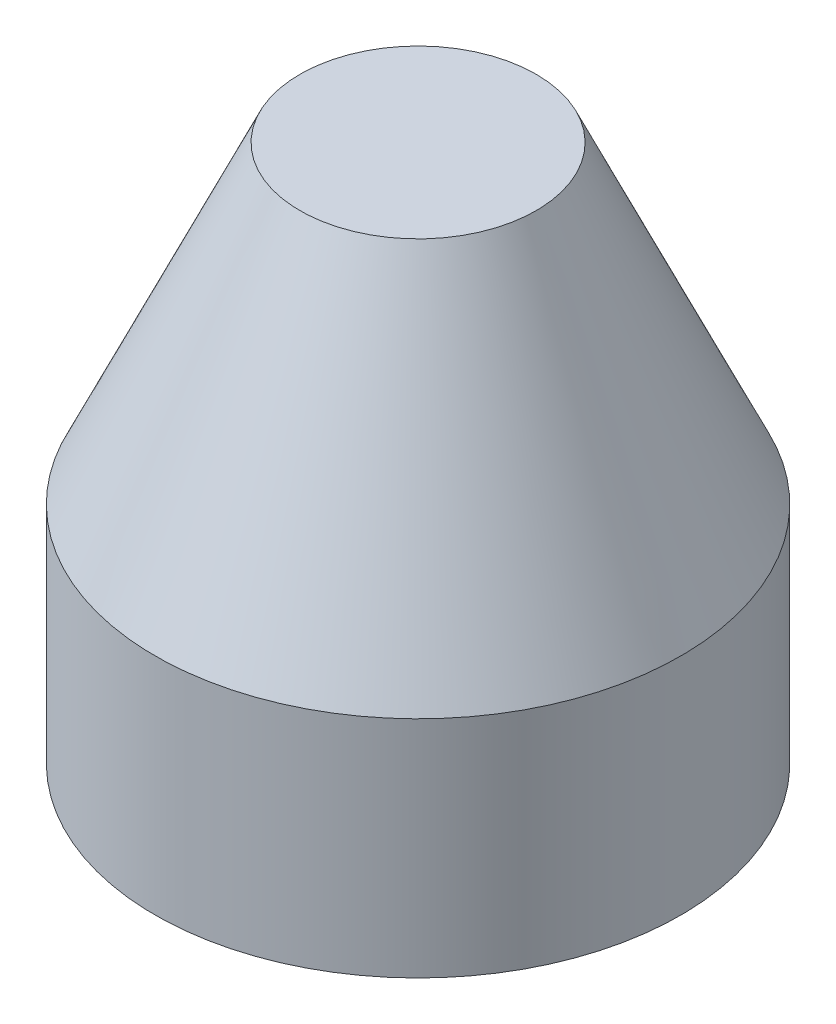
ISO-10303-21;
HEADER;
FILE_DESCRIPTION(('STEP AP214'),'2;1');
FILE_NAME('part.step','',(''),(''),'','','');
FILE_SCHEMA(('AUTOMOTIVE_DESIGN { 1 0 10303 214 1 1 1 1 }'));
ENDSEC;
DATA;
#1=APPLICATION_CONTEXT('core data for automotive mechanical design processes');
#2=APPLICATION_PROTOCOL_DEFINITION('international standard','automotive_design',2000,#1);
#3=PRODUCT_CONTEXT('',#1,'mechanical');
#4=PRODUCT('Part','Part','',(#3));
#5=PRODUCT_RELATED_PRODUCT_CATEGORY('part','',(#4));
#6=PRODUCT_DEFINITION_FORMATION('','',#4);
#7=PRODUCT_DEFINITION_CONTEXT('part definition',#1,'design');
#8=PRODUCT_DEFINITION('design','',#6,#7);
#9=PRODUCT_DEFINITION_SHAPE('','',#8);
#10=(LENGTH_UNIT() NAMED_UNIT(*) SI_UNIT(.MILLI.,.METRE.));
#11=(NAMED_UNIT(*) PLANE_ANGLE_UNIT() SI_UNIT($,.RADIAN.));
#12=(NAMED_UNIT(*) SI_UNIT($,.STERADIAN.) SOLID_ANGLE_UNIT());
#13=UNCERTAINTY_MEASURE_WITH_UNIT(LENGTH_MEASURE(1.E-05),#10,'distance_accuracy_value','');
#14=(GEOMETRIC_REPRESENTATION_CONTEXT(3) GLOBAL_UNCERTAINTY_ASSIGNED_CONTEXT((#13)) GLOBAL_UNIT_ASSIGNED_CONTEXT((#10,
#11,#12)) REPRESENTATION_CONTEXT('',''));
#15=CARTESIAN_POINT('',(0.,0.,0.));
#16=DIRECTION('',(0.,0.,1.));
#17=DIRECTION('',(1.,0.,0.));
#18=AXIS2_PLACEMENT_3D('',#15,#16,#17);
#19=CARTESIAN_POINT('',(0.,0.,0.));
#20=DIRECTION('',(0.,-1.,0.));
#21=DIRECTION('',(0.,0.,-1.));
#22=AXIS2_PLACEMENT_3D('',#19,#20,#21);
#23=PLANE('',#22);
#24=CARTESIAN_POINT('',(0.,0.,0.));
#25=DIRECTION('',(0.,-1.,0.));
#26=DIRECTION('',(0.,0.,-1.));
#27=AXIS2_PLACEMENT_3D('',#24,#25,#26);
#28=CIRCLE('',#27,5.99999999999999);
#29=CARTESIAN_POINT('',(0.,0.,-5.99999999999999));
#30=VERTEX_POINT('',#29);
#31=EDGE_CURVE('E57',#30,#30,#28,.T.);
#32=ORIENTED_EDGE('',*,*,#31,.F.);
#33=EDGE_LOOP('',(#32));
#34=FACE_BOUND('',#33,.T.);
#35=CARTESIAN_POINT('',(0.,0.,0.));
#36=DIRECTION('',(0.,-1.,0.));
#37=DIRECTION('',(0.,0.,-1.));
#38=AXIS2_PLACEMENT_3D('',#35,#36,#37);
#39=CIRCLE('',#38,22.25);
#40=CARTESIAN_POINT('',(0.,0.,-22.25));
#41=VERTEX_POINT('',#40);
#42=EDGE_CURVE('E11',#41,#41,#39,.T.);
#43=ORIENTED_EDGE('',*,*,#42,.T.);
#44=EDGE_LOOP('',(#43));
#45=FACE_BOUND('',#44,.T.);
#46=ADVANCED_FACE('F37',(#34,#45),#23,.T.);
#47=CARTESIAN_POINT('',(0.,0.,0.));
#48=DIRECTION('',(0.,-1.,0.));
#49=DIRECTION('',(0.,0.,-1.));
#50=AXIS2_PLACEMENT_3D('',#47,#48,#49);
#51=CYLINDRICAL_SURFACE('',#50,22.25);
#52=CARTESIAN_POINT('',(0.,19.,0.));
#53=DIRECTION('',(0.,-1.,0.));
#54=DIRECTION('',(0.,0.,-1.));
#55=AXIS2_PLACEMENT_3D('',#52,#53,#54);
#56=CIRCLE('',#55,22.25);
#57=CARTESIAN_POINT('',(0.,19.,-22.25));
#58=VERTEX_POINT('',#57);
#59=EDGE_CURVE('E43',#58,#58,#56,.T.);
#60=ORIENTED_EDGE('',*,*,#59,.T.);
#61=EDGE_LOOP('',(#60));
#62=FACE_BOUND('',#61,.T.);
#63=ORIENTED_EDGE('',*,*,#42,.F.);
#64=EDGE_LOOP('',(#63));
#65=FACE_BOUND('',#64,.T.);
#66=ADVANCED_FACE('F66',(#62,#65),#51,.T.);
#67=CARTESIAN_POINT('',(0.,19.,0.));
#68=DIRECTION('',(0.,-1.,0.));
#69=DIRECTION('',(0.,0.,-1.));
#70=AXIS2_PLACEMENT_3D('',#67,#68,#69);
#71=CONICAL_SURFACE('',#70,22.25,0.432735813423713);
#72=CARTESIAN_POINT('',(0.,45.5188,0.));
#73=DIRECTION('',(0.,-1.,0.));
#74=DIRECTION('',(0.,0.,-1.));
#75=AXIS2_PLACEMENT_3D('',#72,#73,#74);
#76=CIRCLE('',#75,10.);
#77=CARTESIAN_POINT('',(0.,45.5188,-10.));
#78=VERTEX_POINT('',#77);
#79=EDGE_CURVE('E56',#78,#78,#76,.T.);
#80=ORIENTED_EDGE('',*,*,#79,.T.);
#81=EDGE_LOOP('',(#80));
#82=FACE_BOUND('',#81,.T.);
#83=ORIENTED_EDGE('',*,*,#59,.F.);
#84=EDGE_LOOP('',(#83));
#85=FACE_BOUND('',#84,.T.);
#86=ADVANCED_FACE('F69',(#82,#85),#71,.T.);
#87=CARTESIAN_POINT('',(10.,45.5188,0.));
#88=DIRECTION('',(0.,1.,0.));
#89=DIRECTION('',(0.,0.,1.));
#90=AXIS2_PLACEMENT_3D('',#87,#88,#89);
#91=PLANE('',#90);
#92=ORIENTED_EDGE('',*,*,#79,.F.);
#93=EDGE_LOOP('',(#92));
#94=FACE_BOUND('',#93,.T.);
#95=ADVANCED_FACE('F50',(#94),#91,.T.);
#96=CARTESIAN_POINT('',(0.,20.,0.));
#97=DIRECTION('',(0.,-1.,0.));
#98=DIRECTION('',(0.,0.,-1.));
#99=AXIS2_PLACEMENT_3D('',#96,#97,#98);
#100=CONICAL_SURFACE('',#99,5.99999999999999,1.02974425867665);
#101=CARTESIAN_POINT('',(0.,23.6051637141654,0.));
#102=VERTEX_POINT('',#101);
#103=VERTEX_LOOP('',#102);
#104=FACE_BOUND('',#103,.T.);
#105=CARTESIAN_POINT('',(0.,20.,0.));
#106=DIRECTION('',(0.,-1.,0.));
#107=DIRECTION('',(0.,0.,-1.));
#108=AXIS2_PLACEMENT_3D('',#105,#106,#107);
#109=CIRCLE('',#108,5.99999999999999);
#110=CARTESIAN_POINT('',(0.,20.,-5.99999999999999));
#111=VERTEX_POINT('',#110);
#112=EDGE_CURVE('E54',#111,#111,#109,.T.);
#113=ORIENTED_EDGE('',*,*,#112,.T.);
#114=EDGE_LOOP('',(#113));
#115=FACE_BOUND('',#114,.T.);
#116=ADVANCED_FACE('F46',(#104,#115),#100,.F.);
#117=CARTESIAN_POINT('',(0.,0.,0.));
#118=DIRECTION('',(0.,-1.,0.));
#119=DIRECTION('',(0.,0.,-1.));
#120=AXIS2_PLACEMENT_3D('',#117,#118,#119);
#121=CYLINDRICAL_SURFACE('',#120,5.99999999999999);
#122=ORIENTED_EDGE('',*,*,#112,.F.);
#123=EDGE_LOOP('',(#122));
#124=FACE_BOUND('',#123,.T.);
#125=ORIENTED_EDGE('',*,*,#31,.T.);
#126=EDGE_LOOP('',(#125));
#127=FACE_BOUND('',#126,.T.);
#128=ADVANCED_FACE('F49',(#124,#127),#121,.F.);
#129=CLOSED_SHELL('',(#46,#66,#86,#95,#116,#128));
#130=MANIFOLD_SOLID_BREP('B2',#129);
#131=ADVANCED_BREP_SHAPE_REPRESENTATION('',(#18,#130),#14);
#132=SHAPE_DEFINITION_REPRESENTATION(#9,#131);
ENDSEC;
END-ISO-10303-21;
